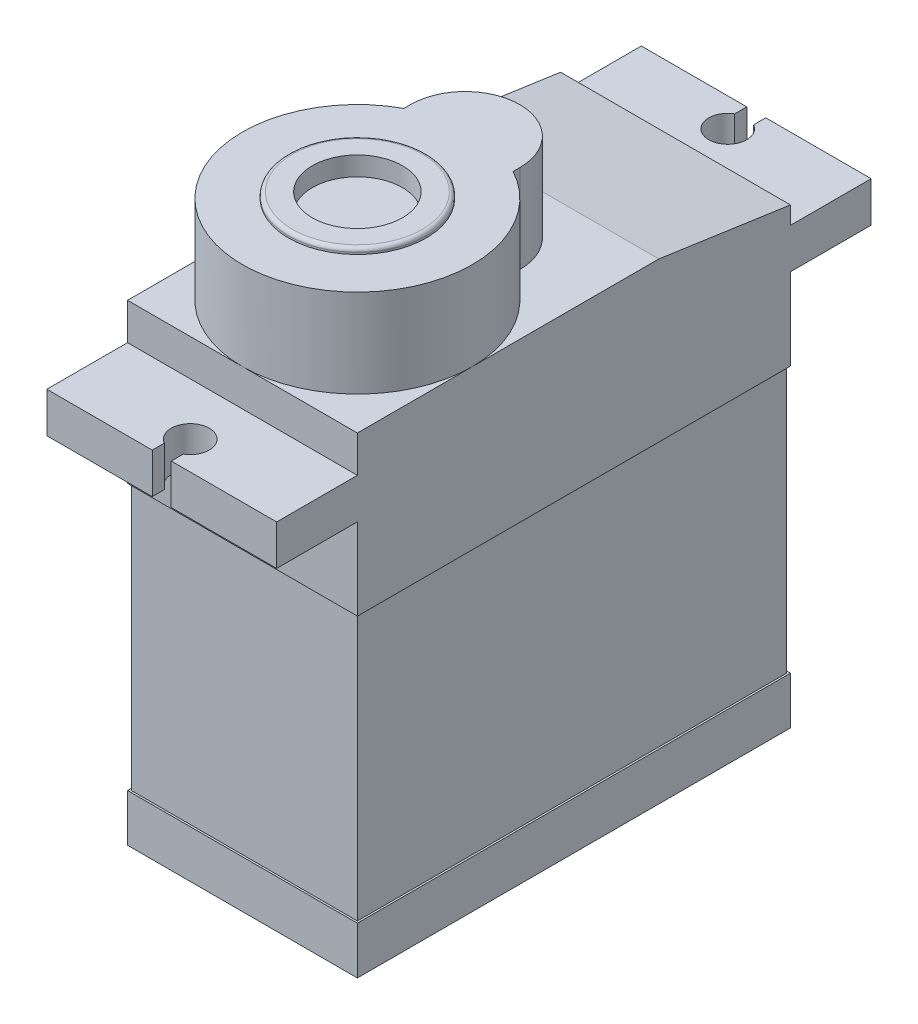
ISO-10303-21;
HEADER;
FILE_DESCRIPTION(('STEP AP214'),'2;1');
FILE_NAME('part.step','',(''),(''),'','','');
FILE_SCHEMA(('AUTOMOTIVE_DESIGN { 1 0 10303 214 1 1 1 1 }'));
ENDSEC;
DATA;
#1=APPLICATION_CONTEXT('core data for automotive mechanical design processes');
#2=APPLICATION_PROTOCOL_DEFINITION('international standard','automotive_design',2000,#1);
#3=PRODUCT_CONTEXT('',#1,'mechanical');
#4=PRODUCT('Part','Part','',(#3));
#5=PRODUCT_RELATED_PRODUCT_CATEGORY('part','',(#4));
#6=PRODUCT_DEFINITION_FORMATION('','',#4);
#7=PRODUCT_DEFINITION_CONTEXT('part definition',#1,'design');
#8=PRODUCT_DEFINITION('design','',#6,#7);
#9=PRODUCT_DEFINITION_SHAPE('','',#8);
#10=(LENGTH_UNIT() NAMED_UNIT(*) SI_UNIT(.MILLI.,.METRE.));
#11=(NAMED_UNIT(*) PLANE_ANGLE_UNIT() SI_UNIT($,.RADIAN.));
#12=(NAMED_UNIT(*) SI_UNIT($,.STERADIAN.) SOLID_ANGLE_UNIT());
#13=UNCERTAINTY_MEASURE_WITH_UNIT(LENGTH_MEASURE(1.E-05),#10,'distance_accuracy_value','');
#14=(GEOMETRIC_REPRESENTATION_CONTEXT(3) GLOBAL_UNCERTAINTY_ASSIGNED_CONTEXT((#13)) GLOBAL_UNIT_ASSIGNED_CONTEXT((#10,
#11,#12)) REPRESENTATION_CONTEXT('',''));
#15=CARTESIAN_POINT('',(0.,0.,0.));
#16=DIRECTION('',(0.,0.,1.));
#17=DIRECTION('',(1.,0.,0.));
#18=AXIS2_PLACEMENT_3D('',#15,#16,#17);
#19=CARTESIAN_POINT('',(6.05,24.85,11.4));
#20=DIRECTION('',(0.,0.,-1.));
#21=DIRECTION('',(-1.,0.,0.));
#22=AXIS2_PLACEMENT_3D('',#19,#20,#21);
#23=PLANE('',#22);
#24=DIRECTION('',(-1.,0.,0.));
#25=VECTOR('',#24,1.);
#26=CARTESIAN_POINT('',(6.05,16.5,11.4));
#27=LINE('',#26,#25);
#28=CARTESIAN_POINT('',(6.05,16.5,11.4));
#29=VERTEX_POINT('',#28);
#30=CARTESIAN_POINT('',(-6.05,16.5,11.4));
#31=VERTEX_POINT('',#30);
#32=EDGE_CURVE('E320',#29,#31,#27,.T.);
#33=ORIENTED_EDGE('',*,*,#32,.F.);
#34=DIRECTION('',(0.,-1.,0.));
#35=VECTOR('',#34,1.);
#36=CARTESIAN_POINT('',(6.05,24.85,11.4));
#37=LINE('',#36,#35);
#38=CARTESIAN_POINT('',(6.05,20.8,11.4));
#39=VERTEX_POINT('',#38);
#40=EDGE_CURVE('E524',#39,#29,#37,.T.);
#41=ORIENTED_EDGE('',*,*,#40,.F.);
#42=DIRECTION('',(1.,0.,0.));
#43=VECTOR('',#42,1.);
#44=CARTESIAN_POINT('',(0.,20.8,11.4));
#45=LINE('',#44,#43);
#46=CARTESIAN_POINT('',(-6.05,20.8,11.4));
#47=VERTEX_POINT('',#46);
#48=EDGE_CURVE('E366',#47,#39,#45,.T.);
#49=ORIENTED_EDGE('',*,*,#48,.F.);
#50=DIRECTION('',(0.,-1.,0.));
#51=VECTOR('',#50,1.);
#52=CARTESIAN_POINT('',(-6.05,24.85,11.4));
#53=LINE('',#52,#51);
#54=EDGE_CURVE('E528',#47,#31,#53,.T.);
#55=ORIENTED_EDGE('',*,*,#54,.T.);
#56=EDGE_LOOP('',(#33,#41,#49,#55));
#57=FACE_BOUND('',#56,.T.);
#58=ADVANCED_FACE('F50',(#57),#23,.F.);
#59=CARTESIAN_POINT('',(-6.05,24.85,11.4));
#60=DIRECTION('',(1.,0.,0.));
#61=DIRECTION('',(0.,0.,-1.));
#62=AXIS2_PLACEMENT_3D('',#59,#60,#61);
#63=PLANE('',#62);
#64=DIRECTION('',(0.,0.,-1.));
#65=VECTOR('',#64,1.);
#66=CARTESIAN_POINT('',(-6.05,16.5,11.4));
#67=LINE('',#66,#65);
#68=CARTESIAN_POINT('',(-6.05,16.5,-11.4));
#69=VERTEX_POINT('',#68);
#70=EDGE_CURVE('E73',#31,#69,#67,.T.);
#71=ORIENTED_EDGE('',*,*,#70,.F.);
#72=ORIENTED_EDGE('',*,*,#54,.F.);
#73=DIRECTION('',(0.,0.,1.));
#74=VECTOR('',#73,1.);
#75=CARTESIAN_POINT('',(-6.05000000000001,20.8,0.));
#76=LINE('',#75,#74);
#77=CARTESIAN_POINT('',(-6.05,20.8,15.65));
#78=VERTEX_POINT('',#77);
#79=EDGE_CURVE('E369',#47,#78,#76,.T.);
#80=ORIENTED_EDGE('',*,*,#79,.T.);
#81=DIRECTION('',(0.,-1.,0.));
#82=VECTOR('',#81,1.);
#83=CARTESIAN_POINT('',(-6.05,22.92,15.65));
#84=LINE('',#83,#82);
#85=CARTESIAN_POINT('',(-6.05,22.92,15.65));
#86=VERTEX_POINT('',#85);
#87=EDGE_CURVE('E374',#86,#78,#84,.T.);
#88=ORIENTED_EDGE('',*,*,#87,.F.);
#89=DIRECTION('',(0.,0.,1.));
#90=VECTOR('',#89,1.);
#91=CARTESIAN_POINT('',(-6.05000000000001,22.92,0.));
#92=LINE('',#91,#90);
#93=CARTESIAN_POINT('',(-6.05,22.92,11.4));
#94=VERTEX_POINT('',#93);
#95=EDGE_CURVE('E352',#94,#86,#92,.T.);
#96=ORIENTED_EDGE('',*,*,#95,.F.);
#97=CARTESIAN_POINT('',(-6.05,24.85,11.4));
#98=VERTEX_POINT('',#97);
#99=EDGE_CURVE('E525',#98,#94,#53,.T.);
#100=ORIENTED_EDGE('',*,*,#99,.F.);
#101=DIRECTION('',(0.,0.,1.));
#102=VECTOR('',#101,1.);
#103=CARTESIAN_POINT('',(-6.05,24.85,11.4));
#104=LINE('',#103,#102);
#105=CARTESIAN_POINT('',(-6.05,24.85,5.35));
#106=VERTEX_POINT('',#105);
#107=EDGE_CURVE('E491',#106,#98,#104,.T.);
#108=ORIENTED_EDGE('',*,*,#107,.F.);
#109=CARTESIAN_POINT('',(-6.05,24.85,-4.47179676972449));
#110=VERTEX_POINT('',#109);
#111=EDGE_CURVE('E487',#110,#106,#104,.T.);
#112=ORIENTED_EDGE('',*,*,#111,.F.);
#113=DIRECTION('',(0.,-0.142857142857142,-0.989743318610787));
#114=VECTOR('',#113,1.);
#115=CARTESIAN_POINT('',(-6.05,23.85,-11.4));
#116=LINE('',#115,#114);
#117=CARTESIAN_POINT('',(-6.05,23.85,-11.4));
#118=VERTEX_POINT('',#117);
#119=EDGE_CURVE('E471',#110,#118,#116,.T.);
#120=ORIENTED_EDGE('',*,*,#119,.T.);
#121=DIRECTION('',(0.,-1.,0.));
#122=VECTOR('',#121,1.);
#123=CARTESIAN_POINT('',(-6.05,24.85,-11.4));
#124=LINE('',#123,#122);
#125=CARTESIAN_POINT('',(-6.05,22.92,-11.4));
#126=VERTEX_POINT('',#125);
#127=EDGE_CURVE('E511',#118,#126,#124,.T.);
#128=ORIENTED_EDGE('',*,*,#127,.T.);
#129=DIRECTION('',(0.,0.,-1.));
#130=VECTOR('',#129,1.);
#131=CARTESIAN_POINT('',(-6.05000000000001,22.92,0.));
#132=LINE('',#131,#130);
#133=CARTESIAN_POINT('',(-6.05,22.92,-15.65));
#134=VERTEX_POINT('',#133);
#135=EDGE_CURVE('E399',#126,#134,#132,.T.);
#136=ORIENTED_EDGE('',*,*,#135,.T.);
#137=DIRECTION('',(0.,-1.,0.));
#138=VECTOR('',#137,1.);
#139=CARTESIAN_POINT('',(-6.05,22.92,-15.65));
#140=LINE('',#139,#138);
#141=CARTESIAN_POINT('',(-6.05,20.8,-15.65));
#142=VERTEX_POINT('',#141);
#143=EDGE_CURVE('E436',#134,#142,#140,.T.);
#144=ORIENTED_EDGE('',*,*,#143,.T.);
#145=DIRECTION('',(0.,0.,-1.));
#146=VECTOR('',#145,1.);
#147=CARTESIAN_POINT('',(-6.05000000000001,20.8,0.));
#148=LINE('',#147,#146);
#149=CARTESIAN_POINT('',(-6.05,20.8,-11.4));
#150=VERTEX_POINT('',#149);
#151=EDGE_CURVE('E420',#150,#142,#148,.T.);
#152=ORIENTED_EDGE('',*,*,#151,.F.);
#153=EDGE_CURVE('E515',#150,#69,#124,.T.);
#154=ORIENTED_EDGE('',*,*,#153,.T.);
#155=EDGE_LOOP('',(#71,#72,#80,#88,#96,#100,#108,#112,#120,#128,#136,#144,#152,#154));
#156=FACE_BOUND('',#155,.T.);
#157=ADVANCED_FACE('F557',(#156),#63,.F.);
#158=CARTESIAN_POINT('',(6.05,24.85,11.4));
#159=DIRECTION('',(-1.,0.,0.));
#160=DIRECTION('',(0.,0.,1.));
#161=AXIS2_PLACEMENT_3D('',#158,#159,#160);
#162=PLANE('',#161);
#163=DIRECTION('',(0.,0.,1.));
#164=VECTOR('',#163,1.);
#165=CARTESIAN_POINT('',(6.05,16.5,-11.4));
#166=LINE('',#165,#164);
#167=CARTESIAN_POINT('',(6.05,16.5,-11.4));
#168=VERTEX_POINT('',#167);
#169=EDGE_CURVE('E325',#168,#29,#166,.T.);
#170=ORIENTED_EDGE('',*,*,#169,.F.);
#171=DIRECTION('',(0.,-1.,0.));
#172=VECTOR('',#171,1.);
#173=CARTESIAN_POINT('',(6.05,24.85,-11.4));
#174=LINE('',#173,#172);
#175=CARTESIAN_POINT('',(6.05,20.8,-11.4));
#176=VERTEX_POINT('',#175);
#177=EDGE_CURVE('E519',#176,#168,#174,.T.);
#178=ORIENTED_EDGE('',*,*,#177,.F.);
#179=DIRECTION('',(0.,0.,-1.));
#180=VECTOR('',#179,1.);
#181=CARTESIAN_POINT('',(6.05,20.8,0.));
#182=LINE('',#181,#180);
#183=CARTESIAN_POINT('',(6.05,20.8,-15.65));
#184=VERTEX_POINT('',#183);
#185=EDGE_CURVE('E426',#176,#184,#182,.T.);
#186=ORIENTED_EDGE('',*,*,#185,.T.);
#187=DIRECTION('',(0.,-1.,0.));
#188=VECTOR('',#187,1.);
#189=CARTESIAN_POINT('',(6.05,22.92,-15.65));
#190=LINE('',#189,#188);
#191=CARTESIAN_POINT('',(6.05,22.92,-15.65));
#192=VERTEX_POINT('',#191);
#193=EDGE_CURVE('E434',#192,#184,#190,.T.);
#194=ORIENTED_EDGE('',*,*,#193,.F.);
#195=DIRECTION('',(0.,0.,-1.));
#196=VECTOR('',#195,1.);
#197=CARTESIAN_POINT('',(6.05,22.92,0.));
#198=LINE('',#197,#196);
#199=CARTESIAN_POINT('',(6.05,22.92,-11.4));
#200=VERTEX_POINT('',#199);
#201=EDGE_CURVE('E406',#200,#192,#198,.T.);
#202=ORIENTED_EDGE('',*,*,#201,.F.);
#203=CARTESIAN_POINT('',(6.05,23.85,-11.4));
#204=VERTEX_POINT('',#203);
#205=EDGE_CURVE('E516',#204,#200,#174,.T.);
#206=ORIENTED_EDGE('',*,*,#205,.F.);
#207=DIRECTION('',(0.,-0.142857142857142,-0.989743318610787));
#208=VECTOR('',#207,1.);
#209=CARTESIAN_POINT('',(6.05,27.0941435438833,11.0760857802097));
#210=LINE('',#209,#208);
#211=CARTESIAN_POINT('',(6.05,24.85,-4.47179676972449));
#212=VERTEX_POINT('',#211);
#213=EDGE_CURVE('E484',#212,#204,#210,.T.);
#214=ORIENTED_EDGE('',*,*,#213,.F.);
#215=DIRECTION('',(0.,0.,-1.));
#216=VECTOR('',#215,1.);
#217=CARTESIAN_POINT('',(6.05,24.85,11.4));
#218=LINE('',#217,#216);
#219=CARTESIAN_POINT('',(6.05,24.85,5.35));
#220=VERTEX_POINT('',#219);
#221=EDGE_CURVE('E495',#220,#212,#218,.T.);
#222=ORIENTED_EDGE('',*,*,#221,.F.);
#223=CARTESIAN_POINT('',(6.05,24.85,11.4));
#224=VERTEX_POINT('',#223);
#225=EDGE_CURVE('E496',#224,#220,#218,.T.);
#226=ORIENTED_EDGE('',*,*,#225,.F.);
#227=CARTESIAN_POINT('',(6.05,22.92,11.4));
#228=VERTEX_POINT('',#227);
#229=EDGE_CURVE('E520',#224,#228,#37,.T.);
#230=ORIENTED_EDGE('',*,*,#229,.T.);
#231=DIRECTION('',(0.,0.,1.));
#232=VECTOR('',#231,1.);
#233=CARTESIAN_POINT('',(6.05000000000001,22.92,0.));
#234=LINE('',#233,#232);
#235=CARTESIAN_POINT('',(6.05,22.92,15.65));
#236=VERTEX_POINT('',#235);
#237=EDGE_CURVE('E346',#228,#236,#234,.T.);
#238=ORIENTED_EDGE('',*,*,#237,.T.);
#239=DIRECTION('',(0.,-1.,0.));
#240=VECTOR('',#239,1.);
#241=CARTESIAN_POINT('',(6.05,22.92,15.65));
#242=LINE('',#241,#240);
#243=CARTESIAN_POINT('',(6.05,20.8,15.65));
#244=VERTEX_POINT('',#243);
#245=EDGE_CURVE('E377',#236,#244,#242,.T.);
#246=ORIENTED_EDGE('',*,*,#245,.T.);
#247=DIRECTION('',(0.,0.,1.));
#248=VECTOR('',#247,1.);
#249=CARTESIAN_POINT('',(6.05000000000001,20.8,0.));
#250=LINE('',#249,#248);
#251=EDGE_CURVE('E363',#39,#244,#250,.T.);
#252=ORIENTED_EDGE('',*,*,#251,.F.);
#253=ORIENTED_EDGE('',*,*,#40,.T.);
#254=EDGE_LOOP('',(#170,#178,#186,#194,#202,#206,#214,#222,#226,#230,#238,#246,#252,#253));
#255=FACE_BOUND('',#254,.T.);
#256=ADVANCED_FACE('F573',(#255),#162,.F.);
#257=CARTESIAN_POINT('',(6.05,24.85,-11.4));
#258=DIRECTION('',(0.,0.,1.));
#259=DIRECTION('',(1.,0.,0.));
#260=AXIS2_PLACEMENT_3D('',#257,#258,#259);
#261=PLANE('',#260);
#262=DIRECTION('',(1.,0.,0.));
#263=VECTOR('',#262,1.);
#264=CARTESIAN_POINT('',(-6.05,16.5,-11.4));
#265=LINE('',#264,#263);
#266=EDGE_CURVE('E323',#69,#168,#265,.T.);
#267=ORIENTED_EDGE('',*,*,#266,.F.);
#268=ORIENTED_EDGE('',*,*,#153,.F.);
#269=DIRECTION('',(1.,0.,0.));
#270=VECTOR('',#269,1.);
#271=CARTESIAN_POINT('',(0.,20.8,-11.4));
#272=LINE('',#271,#270);
#273=EDGE_CURVE('E424',#150,#176,#272,.T.);
#274=ORIENTED_EDGE('',*,*,#273,.T.);
#275=ORIENTED_EDGE('',*,*,#177,.T.);
#276=EDGE_LOOP('',(#267,#268,#274,#275));
#277=FACE_BOUND('',#276,.T.);
#278=ADVANCED_FACE('F606',(#277),#261,.F.);
#279=DIRECTION('',(1.,0.,0.));
#280=VECTOR('',#279,1.);
#281=CARTESIAN_POINT('',(0.,22.92,-11.4));
#282=LINE('',#281,#280);
#283=EDGE_CURVE('E403',#126,#200,#282,.T.);
#284=ORIENTED_EDGE('',*,*,#283,.F.);
#285=ORIENTED_EDGE('',*,*,#127,.F.);
#286=DIRECTION('',(-1.,0.,0.));
#287=VECTOR('',#286,1.);
#288=CARTESIAN_POINT('',(18.8,23.85,-11.4));
#289=LINE('',#288,#287);
#290=EDGE_CURVE('E482',#204,#118,#289,.T.);
#291=ORIENTED_EDGE('',*,*,#290,.F.);
#292=ORIENTED_EDGE('',*,*,#205,.T.);
#293=EDGE_LOOP('',(#284,#285,#291,#292));
#294=FACE_BOUND('',#293,.T.);
#295=ADVANCED_FACE('F581',(#294),#261,.F.);
#296=CARTESIAN_POINT('',(0.,24.85,0.));
#297=DIRECTION('',(0.,1.,0.));
#298=DIRECTION('',(0.,0.,1.));
#299=AXIS2_PLACEMENT_3D('',#296,#297,#298);
#300=PLANE('',#299);
#301=CARTESIAN_POINT('',(0.,24.85,5.35));
#302=DIRECTION('',(0.,1.,0.));
#303=DIRECTION('',(0.,0.,1.));
#304=AXIS2_PLACEMENT_3D('',#301,#302,#303);
#305=CIRCLE('',#304,6.05);
#306=CARTESIAN_POINT('',(0.,24.85,11.4));
#307=VERTEX_POINT('',#306);
#308=EDGE_CURVE('E448',#106,#307,#305,.T.);
#309=ORIENTED_EDGE('',*,*,#308,.F.);
#310=ORIENTED_EDGE('',*,*,#107,.T.);
#311=DIRECTION('',(1.,0.,0.));
#312=VECTOR('',#311,1.);
#313=CARTESIAN_POINT('',(6.05,24.85,11.4));
#314=LINE('',#313,#312);
#315=EDGE_CURVE('E492',#98,#307,#314,.T.);
#316=ORIENTED_EDGE('',*,*,#315,.T.);
#317=EDGE_LOOP('',(#309,#310,#316));
#318=FACE_BOUND('',#317,.T.);
#319=ADVANCED_FACE('F563',(#318),#300,.T.);
#320=EDGE_CURVE('E534',#307,#220,#305,.T.);
#321=ORIENTED_EDGE('',*,*,#320,.F.);
#322=EDGE_CURVE('E490',#307,#224,#314,.T.);
#323=ORIENTED_EDGE('',*,*,#322,.T.);
#324=ORIENTED_EDGE('',*,*,#225,.T.);
#325=EDGE_LOOP('',(#321,#323,#324));
#326=FACE_BOUND('',#325,.T.);
#327=ADVANCED_FACE('F570',(#326),#300,.T.);
#328=CARTESIAN_POINT('',(2.875,24.85,0.0267608545172443));
#329=VERTEX_POINT('',#328);
#330=EDGE_CURVE('E449',#220,#329,#305,.T.);
#331=ORIENTED_EDGE('',*,*,#330,.F.);
#332=ORIENTED_EDGE('',*,*,#221,.T.);
#333=DIRECTION('',(-1.,0.,0.));
#334=VECTOR('',#333,1.);
#335=CARTESIAN_POINT('',(0.,24.85,-4.47179676972449));
#336=LINE('',#335,#334);
#337=EDGE_CURVE('E527',#212,#110,#336,.T.);
#338=ORIENTED_EDGE('',*,*,#337,.T.);
#339=ORIENTED_EDGE('',*,*,#111,.T.);
#340=CARTESIAN_POINT('',(-2.875,24.85,0.0267608545172434));
#341=VERTEX_POINT('',#340);
#342=EDGE_CURVE('E443',#341,#106,#305,.T.);
#343=ORIENTED_EDGE('',*,*,#342,.F.);
#344=DIRECTION('',(0.,0.,1.));
#345=VECTOR('',#344,1.);
#346=CARTESIAN_POINT('',(-2.875,24.85,0.));
#347=LINE('',#346,#345);
#348=CARTESIAN_POINT('',(-2.875,24.85,-0.324999999999999));
#349=VERTEX_POINT('',#348);
#350=EDGE_CURVE('E450',#349,#341,#347,.T.);
#351=ORIENTED_EDGE('',*,*,#350,.F.);
#352=CARTESIAN_POINT('',(0.,24.85,-0.325));
#353=DIRECTION('',(0.,1.,0.));
#354=DIRECTION('',(0.,0.,1.));
#355=AXIS2_PLACEMENT_3D('',#352,#353,#354);
#356=CIRCLE('',#355,2.875);
#357=CARTESIAN_POINT('',(2.875,24.85,-0.325));
#358=VERTEX_POINT('',#357);
#359=EDGE_CURVE('E454',#358,#349,#356,.T.);
#360=ORIENTED_EDGE('',*,*,#359,.F.);
#361=DIRECTION('',(0.,0.,1.));
#362=VECTOR('',#361,1.);
#363=CARTESIAN_POINT('',(2.875,24.85,0.));
#364=LINE('',#363,#362);
#365=EDGE_CURVE('E446',#358,#329,#364,.T.);
#366=ORIENTED_EDGE('',*,*,#365,.T.);
#367=EDGE_LOOP('',(#331,#332,#338,#339,#343,#351,#360,#366));
#368=FACE_BOUND('',#367,.T.);
#369=ADVANCED_FACE('F552',(#368),#300,.T.);
#370=ORIENTED_EDGE('',*,*,#99,.T.);
#371=DIRECTION('',(1.,0.,0.));
#372=VECTOR('',#371,1.);
#373=CARTESIAN_POINT('',(0.,22.92,11.4));
#374=LINE('',#373,#372);
#375=EDGE_CURVE('E350',#94,#228,#374,.T.);
#376=ORIENTED_EDGE('',*,*,#375,.T.);
#377=ORIENTED_EDGE('',*,*,#229,.F.);
#378=ORIENTED_EDGE('',*,*,#322,.F.);
#379=ORIENTED_EDGE('',*,*,#315,.F.);
#380=EDGE_LOOP('',(#370,#376,#377,#378,#379));
#381=FACE_BOUND('',#380,.T.);
#382=ADVANCED_FACE('F566',(#381),#23,.F.);
#383=CARTESIAN_POINT('',(18.8,23.85,-11.4));
#384=DIRECTION('',(0.,0.989743318610787,-0.142857142857142));
#385=DIRECTION('',(0.,0.142857142857142,0.989743318610787));
#386=AXIS2_PLACEMENT_3D('',#383,#384,#385);
#387=PLANE('',#386);
#388=ORIENTED_EDGE('',*,*,#213,.T.);
#389=ORIENTED_EDGE('',*,*,#290,.T.);
#390=ORIENTED_EDGE('',*,*,#119,.F.);
#391=ORIENTED_EDGE('',*,*,#337,.F.);
#392=EDGE_LOOP('',(#388,#389,#390,#391));
#393=FACE_BOUND('',#392,.T.);
#394=ADVANCED_FACE('F578',(#393),#387,.T.);
#395=CARTESIAN_POINT('',(2.875,77.9623310803287,0.));
#396=DIRECTION('',(1.,0.,0.));
#397=DIRECTION('',(0.,0.,-1.));
#398=AXIS2_PLACEMENT_3D('',#395,#396,#397);
#399=PLANE('',#398);
#400=DIRECTION('',(0.,-1.,0.));
#401=VECTOR('',#400,1.);
#402=CARTESIAN_POINT('',(2.875,77.9623310803287,-0.325));
#403=LINE('',#402,#401);
#404=CARTESIAN_POINT('',(2.875,29.5,-0.325));
#405=VERTEX_POINT('',#404);
#406=EDGE_CURVE('E457',#405,#358,#403,.T.);
#407=ORIENTED_EDGE('',*,*,#406,.F.);
#408=DIRECTION('',(0.,0.,1.));
#409=VECTOR('',#408,1.);
#410=CARTESIAN_POINT('',(2.875,29.5,0.));
#411=LINE('',#410,#409);
#412=CARTESIAN_POINT('',(2.875,29.5,0.026760854517245));
#413=VERTEX_POINT('',#412);
#414=EDGE_CURVE('E442',#405,#413,#411,.T.);
#415=ORIENTED_EDGE('',*,*,#414,.T.);
#416=DIRECTION('',(0.,-1.,0.));
#417=VECTOR('',#416,1.);
#418=CARTESIAN_POINT('',(2.875,77.9623310803287,0.0267608545172443));
#419=LINE('',#418,#417);
#420=EDGE_CURVE('E468',#413,#329,#419,.T.);
#421=ORIENTED_EDGE('',*,*,#420,.T.);
#422=ORIENTED_EDGE('',*,*,#365,.F.);
#423=EDGE_LOOP('',(#407,#415,#421,#422));
#424=FACE_BOUND('',#423,.T.);
#425=ADVANCED_FACE('F545',(#424),#399,.T.);
#426=CARTESIAN_POINT('',(0.,77.9623310803287,-0.325));
#427=DIRECTION('',(0.,-1.,0.));
#428=DIRECTION('',(0.,0.,-1.));
#429=AXIS2_PLACEMENT_3D('',#426,#427,#428);
#430=CYLINDRICAL_SURFACE('',#429,2.875);
#431=CARTESIAN_POINT('',(0.,29.5,-0.325));
#432=DIRECTION('',(0.,1.,0.));
#433=DIRECTION('',(0.,0.,1.));
#434=AXIS2_PLACEMENT_3D('',#431,#432,#433);
#435=CIRCLE('',#434,2.875);
#436=CARTESIAN_POINT('',(-2.875,29.5,-0.324999999999999));
#437=VERTEX_POINT('',#436);
#438=EDGE_CURVE('E459',#405,#437,#435,.T.);
#439=ORIENTED_EDGE('',*,*,#438,.F.);
#440=ORIENTED_EDGE('',*,*,#406,.T.);
#441=ORIENTED_EDGE('',*,*,#359,.T.);
#442=DIRECTION('',(0.,-1.,0.));
#443=VECTOR('',#442,1.);
#444=CARTESIAN_POINT('',(-2.875,77.9623310803287,-0.324999999999999));
#445=LINE('',#444,#443);
#446=EDGE_CURVE('E453',#437,#349,#445,.T.);
#447=ORIENTED_EDGE('',*,*,#446,.F.);
#448=EDGE_LOOP('',(#439,#440,#441,#447));
#449=FACE_BOUND('',#448,.T.);
#450=ADVANCED_FACE('F734',(#449),#430,.T.);
#451=CARTESIAN_POINT('',(-2.875,77.9623310803287,0.));
#452=DIRECTION('',(1.,0.,0.));
#453=DIRECTION('',(0.,0.,-1.));
#454=AXIS2_PLACEMENT_3D('',#451,#452,#453);
#455=PLANE('',#454);
#456=DIRECTION('',(0.,0.,1.));
#457=VECTOR('',#456,1.);
#458=CARTESIAN_POINT('',(-2.875,29.5,0.));
#459=LINE('',#458,#457);
#460=CARTESIAN_POINT('',(-2.875,29.5,0.0267608545172434));
#461=VERTEX_POINT('',#460);
#462=EDGE_CURVE('E460',#437,#461,#459,.T.);
#463=ORIENTED_EDGE('',*,*,#462,.F.);
#464=ORIENTED_EDGE('',*,*,#446,.T.);
#465=ORIENTED_EDGE('',*,*,#350,.T.);
#466=DIRECTION('',(0.,-1.,0.));
#467=VECTOR('',#466,1.);
#468=CARTESIAN_POINT('',(-2.875,77.9623310803287,0.0267608545172434));
#469=LINE('',#468,#467);
#470=EDGE_CURVE('E447',#461,#341,#469,.T.);
#471=ORIENTED_EDGE('',*,*,#470,.F.);
#472=EDGE_LOOP('',(#463,#464,#465,#471));
#473=FACE_BOUND('',#472,.T.);
#474=ADVANCED_FACE('F550',(#473),#455,.F.);
#475=CARTESIAN_POINT('',(0.,77.9623310803287,5.35));
#476=DIRECTION('',(0.,-1.,0.));
#477=DIRECTION('',(0.,0.,-1.));
#478=AXIS2_PLACEMENT_3D('',#475,#476,#477);
#479=CYLINDRICAL_SURFACE('',#478,6.05);
#480=CARTESIAN_POINT('',(0.,29.5,5.35));
#481=DIRECTION('',(0.,1.,0.));
#482=DIRECTION('',(0.,0.,1.));
#483=AXIS2_PLACEMENT_3D('',#480,#481,#482);
#484=CIRCLE('',#483,6.05);
#485=EDGE_CURVE('E463',#461,#413,#484,.T.);
#486=ORIENTED_EDGE('',*,*,#485,.F.);
#487=ORIENTED_EDGE('',*,*,#470,.T.);
#488=ORIENTED_EDGE('',*,*,#342,.T.);
#489=ORIENTED_EDGE('',*,*,#308,.T.);
#490=ORIENTED_EDGE('',*,*,#320,.T.);
#491=ORIENTED_EDGE('',*,*,#330,.T.);
#492=ORIENTED_EDGE('',*,*,#420,.F.);
#493=EDGE_LOOP('',(#486,#487,#488,#489,#490,#491,#492));
#494=FACE_BOUND('',#493,.T.);
#495=ADVANCED_FACE('F539',(#494),#479,.T.);
#496=CARTESIAN_POINT('',(0.,29.5,0.));
#497=DIRECTION('',(0.,1.,0.));
#498=DIRECTION('',(0.,0.,1.));
#499=AXIS2_PLACEMENT_3D('',#496,#497,#498);
#500=PLANE('',#499);
#501=CARTESIAN_POINT('',(0.,29.5,5.35));
#502=DIRECTION('',(0.,1.,0.));
#503=DIRECTION('',(0.,0.,1.));
#504=AXIS2_PLACEMENT_3D('',#501,#502,#503);
#505=CIRCLE('',#504,3.625);
#506=CARTESIAN_POINT('',(0.,29.5,8.975));
#507=VERTEX_POINT('',#506);
#508=EDGE_CURVE('E305',#507,#507,#505,.T.);
#509=ORIENTED_EDGE('',*,*,#508,.F.);
#510=EDGE_LOOP('',(#509));
#511=FACE_BOUND('',#510,.T.);
#512=ORIENTED_EDGE('',*,*,#414,.F.);
#513=ORIENTED_EDGE('',*,*,#438,.T.);
#514=ORIENTED_EDGE('',*,*,#462,.T.);
#515=ORIENTED_EDGE('',*,*,#485,.T.);
#516=EDGE_LOOP('',(#512,#513,#514,#515));
#517=FACE_BOUND('',#516,.T.);
#518=ADVANCED_FACE('F548',(#511,#517),#500,.T.);
#519=CARTESIAN_POINT('',(0.,22.92,-14.15));
#520=DIRECTION('',(0.,-1.,0.));
#521=DIRECTION('',(0.,0.,-1.));
#522=AXIS2_PLACEMENT_3D('',#519,#520,#521);
#523=CYLINDRICAL_SURFACE('',#522,1.);
#524=CARTESIAN_POINT('',(0.,20.8,-14.15));
#525=DIRECTION('',(0.,1.,0.));
#526=DIRECTION('',(0.,0.,1.));
#527=AXIS2_PLACEMENT_3D('',#524,#525,#526);
#528=CIRCLE('',#527,1.);
#529=CARTESIAN_POINT('',(-0.500000000000002,20.8,-15.0160254037844));
#530=VERTEX_POINT('',#529);
#531=CARTESIAN_POINT('',(0.499999999999994,20.8,-15.0160254037844));
#532=VERTEX_POINT('',#531);
#533=EDGE_CURVE('E388',#530,#532,#528,.T.);
#534=ORIENTED_EDGE('',*,*,#533,.F.);
#535=DIRECTION('',(0.,-1.,0.));
#536=VECTOR('',#535,1.);
#537=CARTESIAN_POINT('',(-0.500000000000002,22.92,-15.0160254037844));
#538=LINE('',#537,#536);
#539=CARTESIAN_POINT('',(-0.500000000000002,22.92,-15.0160254037844));
#540=VERTEX_POINT('',#539);
#541=EDGE_CURVE('E440',#540,#530,#538,.T.);
#542=ORIENTED_EDGE('',*,*,#541,.F.);
#543=CARTESIAN_POINT('',(0.,22.92,-14.15));
#544=DIRECTION('',(0.,1.,0.));
#545=DIRECTION('',(0.,0.,1.));
#546=AXIS2_PLACEMENT_3D('',#543,#544,#545);
#547=CIRCLE('',#546,1.);
#548=CARTESIAN_POINT('',(0.499999999999994,22.92,-15.0160254037844));
#549=VERTEX_POINT('',#548);
#550=EDGE_CURVE('E389',#540,#549,#547,.T.);
#551=ORIENTED_EDGE('',*,*,#550,.T.);
#552=DIRECTION('',(0.,-1.,0.));
#553=VECTOR('',#552,1.);
#554=CARTESIAN_POINT('',(0.499999999999994,22.92,-15.0160254037844));
#555=LINE('',#554,#553);
#556=EDGE_CURVE('E411',#549,#532,#555,.T.);
#557=ORIENTED_EDGE('',*,*,#556,.T.);
#558=EDGE_LOOP('',(#534,#542,#551,#557));
#559=FACE_BOUND('',#558,.T.);
#560=ADVANCED_FACE('F724',(#559),#523,.F.);
#561=CARTESIAN_POINT('',(-0.499999999999996,22.92,0.));
#562=DIRECTION('',(1.,0.,0.));
#563=DIRECTION('',(0.,0.,-1.));
#564=AXIS2_PLACEMENT_3D('',#561,#562,#563);
#565=PLANE('',#564);
#566=DIRECTION('',(0.,0.,1.));
#567=VECTOR('',#566,1.);
#568=CARTESIAN_POINT('',(-0.499999999999996,20.8,0.));
#569=LINE('',#568,#567);
#570=CARTESIAN_POINT('',(-0.500000000000002,20.8,-15.65));
#571=VERTEX_POINT('',#570);
#572=EDGE_CURVE('E414',#571,#530,#569,.T.);
#573=ORIENTED_EDGE('',*,*,#572,.F.);
#574=DIRECTION('',(0.,-1.,0.));
#575=VECTOR('',#574,1.);
#576=CARTESIAN_POINT('',(-0.500000000000002,22.92,-15.65));
#577=LINE('',#576,#575);
#578=CARTESIAN_POINT('',(-0.500000000000002,22.92,-15.65));
#579=VERTEX_POINT('',#578);
#580=EDGE_CURVE('E438',#579,#571,#577,.T.);
#581=ORIENTED_EDGE('',*,*,#580,.F.);
#582=DIRECTION('',(0.,0.,1.));
#583=VECTOR('',#582,1.);
#584=CARTESIAN_POINT('',(-0.499999999999996,22.92,0.));
#585=LINE('',#584,#583);
#586=EDGE_CURVE('E392',#579,#540,#585,.T.);
#587=ORIENTED_EDGE('',*,*,#586,.T.);
#588=ORIENTED_EDGE('',*,*,#541,.T.);
#589=EDGE_LOOP('',(#573,#581,#587,#588));
#590=FACE_BOUND('',#589,.T.);
#591=ADVANCED_FACE('F728',(#590),#565,.T.);
#592=CARTESIAN_POINT('',(0.,22.92,-15.65));
#593=DIRECTION('',(0.,0.,-1.));
#594=DIRECTION('',(-1.,0.,0.));
#595=AXIS2_PLACEMENT_3D('',#592,#593,#594);
#596=PLANE('',#595);
#597=DIRECTION('',(1.,0.,0.));
#598=VECTOR('',#597,1.);
#599=CARTESIAN_POINT('',(0.,20.8,-15.65));
#600=LINE('',#599,#598);
#601=EDGE_CURVE('E417',#142,#571,#600,.T.);
#602=ORIENTED_EDGE('',*,*,#601,.F.);
#603=ORIENTED_EDGE('',*,*,#143,.F.);
#604=DIRECTION('',(1.,0.,0.));
#605=VECTOR('',#604,1.);
#606=CARTESIAN_POINT('',(0.,22.92,-15.65));
#607=LINE('',#606,#605);
#608=EDGE_CURVE('E396',#134,#579,#607,.T.);
#609=ORIENTED_EDGE('',*,*,#608,.T.);
#610=ORIENTED_EDGE('',*,*,#580,.T.);
#611=EDGE_LOOP('',(#602,#603,#609,#610));
#612=FACE_BOUND('',#611,.T.);
#613=ADVANCED_FACE('F596',(#612),#596,.T.);
#614=CARTESIAN_POINT('',(0.499999999999994,20.8,-15.65));
#615=VERTEX_POINT('',#614);
#616=EDGE_CURVE('E421',#615,#184,#600,.T.);
#617=ORIENTED_EDGE('',*,*,#616,.F.);
#618=DIRECTION('',(0.,-1.,0.));
#619=VECTOR('',#618,1.);
#620=CARTESIAN_POINT('',(0.499999999999994,22.92,-15.65));
#621=LINE('',#620,#619);
#622=CARTESIAN_POINT('',(0.499999999999994,22.92,-15.65));
#623=VERTEX_POINT('',#622);
#624=EDGE_CURVE('E432',#623,#615,#621,.T.);
#625=ORIENTED_EDGE('',*,*,#624,.F.);
#626=EDGE_CURVE('E400',#623,#192,#607,.T.);
#627=ORIENTED_EDGE('',*,*,#626,.T.);
#628=ORIENTED_EDGE('',*,*,#193,.T.);
#629=EDGE_LOOP('',(#617,#625,#627,#628));
#630=FACE_BOUND('',#629,.T.);
#631=ADVANCED_FACE('F743',(#630),#596,.T.);
#632=CARTESIAN_POINT('',(0.499999999999997,22.92,0.));
#633=DIRECTION('',(-1.,0.,0.));
#634=DIRECTION('',(0.,0.,1.));
#635=AXIS2_PLACEMENT_3D('',#632,#633,#634);
#636=PLANE('',#635);
#637=DIRECTION('',(0.,0.,-1.));
#638=VECTOR('',#637,1.);
#639=CARTESIAN_POINT('',(0.499999999999997,20.8,0.));
#640=LINE('',#639,#638);
#641=EDGE_CURVE('E393',#532,#615,#640,.T.);
#642=ORIENTED_EDGE('',*,*,#641,.F.);
#643=ORIENTED_EDGE('',*,*,#556,.F.);
#644=DIRECTION('',(0.,0.,-1.));
#645=VECTOR('',#644,1.);
#646=CARTESIAN_POINT('',(0.499999999999997,22.92,0.));
#647=LINE('',#646,#645);
#648=EDGE_CURVE('E408',#549,#623,#647,.T.);
#649=ORIENTED_EDGE('',*,*,#648,.T.);
#650=ORIENTED_EDGE('',*,*,#624,.T.);
#651=EDGE_LOOP('',(#642,#643,#649,#650));
#652=FACE_BOUND('',#651,.T.);
#653=ADVANCED_FACE('F746',(#652),#636,.T.);
#654=CARTESIAN_POINT('',(0.,22.92,0.));
#655=DIRECTION('',(0.,1.,0.));
#656=DIRECTION('',(0.,0.,1.));
#657=AXIS2_PLACEMENT_3D('',#654,#655,#656);
#658=PLANE('',#657);
#659=ORIENTED_EDGE('',*,*,#550,.F.);
#660=ORIENTED_EDGE('',*,*,#586,.F.);
#661=ORIENTED_EDGE('',*,*,#608,.F.);
#662=ORIENTED_EDGE('',*,*,#135,.F.);
#663=ORIENTED_EDGE('',*,*,#283,.T.);
#664=ORIENTED_EDGE('',*,*,#201,.T.);
#665=ORIENTED_EDGE('',*,*,#626,.F.);
#666=ORIENTED_EDGE('',*,*,#648,.F.);
#667=EDGE_LOOP('',(#659,#660,#661,#662,#663,#664,#665,#666));
#668=FACE_BOUND('',#667,.T.);
#669=ADVANCED_FACE('F588',(#668),#658,.T.);
#670=CARTESIAN_POINT('',(0.,20.8,0.));
#671=DIRECTION('',(0.,1.,0.));
#672=DIRECTION('',(0.,0.,1.));
#673=AXIS2_PLACEMENT_3D('',#670,#671,#672);
#674=PLANE('',#673);
#675=ORIENTED_EDGE('',*,*,#533,.T.);
#676=ORIENTED_EDGE('',*,*,#641,.T.);
#677=ORIENTED_EDGE('',*,*,#616,.T.);
#678=ORIENTED_EDGE('',*,*,#185,.F.);
#679=ORIENTED_EDGE('',*,*,#273,.F.);
#680=ORIENTED_EDGE('',*,*,#151,.T.);
#681=ORIENTED_EDGE('',*,*,#601,.T.);
#682=ORIENTED_EDGE('',*,*,#572,.T.);
#683=EDGE_LOOP('',(#675,#676,#677,#678,#679,#680,#681,#682));
#684=FACE_BOUND('',#683,.T.);
#685=ADVANCED_FACE('F600',(#684),#674,.F.);
#686=CARTESIAN_POINT('',(-0.499999999999998,22.92,0.));
#687=DIRECTION('',(-1.,0.,0.));
#688=DIRECTION('',(0.,0.,1.));
#689=AXIS2_PLACEMENT_3D('',#686,#687,#688);
#690=PLANE('',#689);
#691=DIRECTION('',(0.,0.,-1.));
#692=VECTOR('',#691,1.);
#693=CARTESIAN_POINT('',(-0.499999999999998,20.8,0.));
#694=LINE('',#693,#692);
#695=CARTESIAN_POINT('',(-0.500000000000003,20.8,15.65));
#696=VERTEX_POINT('',#695);
#697=CARTESIAN_POINT('',(-0.500000000000003,20.8,15.0160254037844));
#698=VERTEX_POINT('',#697);
#699=EDGE_CURVE('E327',#696,#698,#694,.T.);
#700=ORIENTED_EDGE('',*,*,#699,.T.);
#701=DIRECTION('',(0.,-1.,0.));
#702=VECTOR('',#701,1.);
#703=CARTESIAN_POINT('',(-0.500000000000003,22.92,15.0160254037844));
#704=LINE('',#703,#702);
#705=CARTESIAN_POINT('',(-0.500000000000003,22.92,15.0160254037844));
#706=VERTEX_POINT('',#705);
#707=EDGE_CURVE('E385',#706,#698,#704,.T.);
#708=ORIENTED_EDGE('',*,*,#707,.F.);
#709=DIRECTION('',(0.,0.,-1.));
#710=VECTOR('',#709,1.);
#711=CARTESIAN_POINT('',(-0.499999999999998,22.92,0.));
#712=LINE('',#711,#710);
#713=CARTESIAN_POINT('',(-0.500000000000003,22.92,15.65));
#714=VERTEX_POINT('',#713);
#715=EDGE_CURVE('E336',#714,#706,#712,.T.);
#716=ORIENTED_EDGE('',*,*,#715,.F.);
#717=DIRECTION('',(0.,-1.,0.));
#718=VECTOR('',#717,1.);
#719=CARTESIAN_POINT('',(-0.500000000000003,22.92,15.65));
#720=LINE('',#719,#718);
#721=EDGE_CURVE('E371',#714,#696,#720,.T.);
#722=ORIENTED_EDGE('',*,*,#721,.T.);
#723=EDGE_LOOP('',(#700,#708,#716,#722));
#724=FACE_BOUND('',#723,.T.);
#725=ADVANCED_FACE('F753',(#724),#690,.F.);
#726=CARTESIAN_POINT('',(0.,22.92,14.15));
#727=DIRECTION('',(0.,-1.,0.));
#728=DIRECTION('',(0.,0.,-1.));
#729=AXIS2_PLACEMENT_3D('',#726,#727,#728);
#730=CYLINDRICAL_SURFACE('',#729,1.);
#731=CARTESIAN_POINT('',(0.,20.8,14.15));
#732=DIRECTION('',(0.,1.,0.));
#733=DIRECTION('',(0.,0.,1.));
#734=AXIS2_PLACEMENT_3D('',#731,#732,#733);
#735=CIRCLE('',#734,1.);
#736=CARTESIAN_POINT('',(0.499999999999992,20.8,15.0160254037844));
#737=VERTEX_POINT('',#736);
#738=EDGE_CURVE('E356',#698,#737,#735,.F.);
#739=ORIENTED_EDGE('',*,*,#738,.T.);
#740=DIRECTION('',(0.,-1.,0.));
#741=VECTOR('',#740,1.);
#742=CARTESIAN_POINT('',(0.499999999999992,22.92,15.0160254037844));
#743=LINE('',#742,#741);
#744=CARTESIAN_POINT('',(0.499999999999992,22.92,15.0160254037844));
#745=VERTEX_POINT('',#744);
#746=EDGE_CURVE('E382',#745,#737,#743,.T.);
#747=ORIENTED_EDGE('',*,*,#746,.F.);
#748=CARTESIAN_POINT('',(0.,22.92,14.15));
#749=DIRECTION('',(0.,1.,0.));
#750=DIRECTION('',(0.,0.,1.));
#751=AXIS2_PLACEMENT_3D('',#748,#749,#750);
#752=CIRCLE('',#751,1.);
#753=EDGE_CURVE('E339',#706,#745,#752,.F.);
#754=ORIENTED_EDGE('',*,*,#753,.F.);
#755=ORIENTED_EDGE('',*,*,#707,.T.);
#756=EDGE_LOOP('',(#739,#747,#754,#755));
#757=FACE_BOUND('',#756,.T.);
#758=ADVANCED_FACE('F758',(#757),#730,.F.);
#759=CARTESIAN_POINT('',(0.499999999999995,22.92,0.));
#760=DIRECTION('',(1.,0.,0.));
#761=DIRECTION('',(0.,0.,-1.));
#762=AXIS2_PLACEMENT_3D('',#759,#760,#761);
#763=PLANE('',#762);
#764=DIRECTION('',(0.,0.,1.));
#765=VECTOR('',#764,1.);
#766=CARTESIAN_POINT('',(0.499999999999995,20.8,0.));
#767=LINE('',#766,#765);
#768=CARTESIAN_POINT('',(0.499999999999992,20.8,15.65));
#769=VERTEX_POINT('',#768);
#770=EDGE_CURVE('E358',#737,#769,#767,.T.);
#771=ORIENTED_EDGE('',*,*,#770,.T.);
#772=DIRECTION('',(0.,-1.,0.));
#773=VECTOR('',#772,1.);
#774=CARTESIAN_POINT('',(0.499999999999992,22.92,15.65));
#775=LINE('',#774,#773);
#776=CARTESIAN_POINT('',(0.499999999999992,22.92,15.65));
#777=VERTEX_POINT('',#776);
#778=EDGE_CURVE('E379',#777,#769,#775,.T.);
#779=ORIENTED_EDGE('',*,*,#778,.F.);
#780=DIRECTION('',(0.,0.,1.));
#781=VECTOR('',#780,1.);
#782=CARTESIAN_POINT('',(0.499999999999995,22.92,0.));
#783=LINE('',#782,#781);
#784=EDGE_CURVE('E342',#745,#777,#783,.T.);
#785=ORIENTED_EDGE('',*,*,#784,.F.);
#786=ORIENTED_EDGE('',*,*,#746,.T.);
#787=EDGE_LOOP('',(#771,#779,#785,#786));
#788=FACE_BOUND('',#787,.T.);
#789=ADVANCED_FACE('F762',(#788),#763,.F.);
#790=CARTESIAN_POINT('',(0.,22.92,15.65));
#791=DIRECTION('',(0.,0.,-1.));
#792=DIRECTION('',(-1.,0.,0.));
#793=AXIS2_PLACEMENT_3D('',#790,#791,#792);
#794=PLANE('',#793);
#795=DIRECTION('',(1.,0.,0.));
#796=VECTOR('',#795,1.);
#797=CARTESIAN_POINT('',(0.,20.8,15.65));
#798=LINE('',#797,#796);
#799=EDGE_CURVE('E360',#769,#244,#798,.T.);
#800=ORIENTED_EDGE('',*,*,#799,.T.);
#801=ORIENTED_EDGE('',*,*,#245,.F.);
#802=DIRECTION('',(1.,0.,0.));
#803=VECTOR('',#802,1.);
#804=CARTESIAN_POINT('',(0.,22.92,15.65));
#805=LINE('',#804,#803);
#806=EDGE_CURVE('E344',#777,#236,#805,.T.);
#807=ORIENTED_EDGE('',*,*,#806,.F.);
#808=ORIENTED_EDGE('',*,*,#778,.T.);
#809=EDGE_LOOP('',(#800,#801,#807,#808));
#810=FACE_BOUND('',#809,.T.);
#811=ADVANCED_FACE('F766',(#810),#794,.F.);
#812=EDGE_CURVE('E340',#78,#696,#798,.T.);
#813=ORIENTED_EDGE('',*,*,#812,.T.);
#814=ORIENTED_EDGE('',*,*,#721,.F.);
#815=EDGE_CURVE('E347',#86,#714,#805,.T.);
#816=ORIENTED_EDGE('',*,*,#815,.F.);
#817=ORIENTED_EDGE('',*,*,#87,.T.);
#818=EDGE_LOOP('',(#813,#814,#816,#817));
#819=FACE_BOUND('',#818,.T.);
#820=ADVANCED_FACE('F768',(#819),#794,.F.);
#821=CARTESIAN_POINT('',(0.,22.92,0.));
#822=DIRECTION('',(0.,1.,0.));
#823=DIRECTION('',(0.,0.,1.));
#824=AXIS2_PLACEMENT_3D('',#821,#822,#823);
#825=PLANE('',#824);
#826=ORIENTED_EDGE('',*,*,#715,.T.);
#827=ORIENTED_EDGE('',*,*,#753,.T.);
#828=ORIENTED_EDGE('',*,*,#784,.T.);
#829=ORIENTED_EDGE('',*,*,#806,.T.);
#830=ORIENTED_EDGE('',*,*,#237,.F.);
#831=ORIENTED_EDGE('',*,*,#375,.F.);
#832=ORIENTED_EDGE('',*,*,#95,.T.);
#833=ORIENTED_EDGE('',*,*,#815,.T.);
#834=EDGE_LOOP('',(#826,#827,#828,#829,#830,#831,#832,#833));
#835=FACE_BOUND('',#834,.T.);
#836=ADVANCED_FACE('F771',(#835),#825,.T.);
#837=CARTESIAN_POINT('',(0.,20.8,0.));
#838=DIRECTION('',(0.,1.,0.));
#839=DIRECTION('',(0.,0.,1.));
#840=AXIS2_PLACEMENT_3D('',#837,#838,#839);
#841=PLANE('',#840);
#842=ORIENTED_EDGE('',*,*,#699,.F.);
#843=ORIENTED_EDGE('',*,*,#812,.F.);
#844=ORIENTED_EDGE('',*,*,#79,.F.);
#845=ORIENTED_EDGE('',*,*,#48,.T.);
#846=ORIENTED_EDGE('',*,*,#251,.T.);
#847=ORIENTED_EDGE('',*,*,#799,.F.);
#848=ORIENTED_EDGE('',*,*,#770,.F.);
#849=ORIENTED_EDGE('',*,*,#738,.F.);
#850=EDGE_LOOP('',(#842,#843,#844,#845,#846,#847,#848,#849));
#851=FACE_BOUND('',#850,.T.);
#852=ADVANCED_FACE('F641',(#851),#841,.F.);
#853=CARTESIAN_POINT('',(0.,16.5,0.));
#854=DIRECTION('',(0.,-1.,0.));
#855=DIRECTION('',(0.,0.,-1.));
#856=AXIS2_PLACEMENT_3D('',#853,#854,#855);
#857=PLANE('',#856);
#858=DIRECTION('',(1.,0.,0.));
#859=VECTOR('',#858,1.);
#860=CARTESIAN_POINT('',(-5.95,16.5,-11.3));
#861=LINE('',#860,#859);
#862=CARTESIAN_POINT('',(-5.95,16.5,-11.3));
#863=VERTEX_POINT('',#862);
#864=CARTESIAN_POINT('',(5.95,16.5,-11.3));
#865=VERTEX_POINT('',#864);
#866=EDGE_CURVE('E285',#863,#865,#861,.T.);
#867=ORIENTED_EDGE('',*,*,#866,.F.);
#868=DIRECTION('',(0.,0.,-1.));
#869=VECTOR('',#868,1.);
#870=CARTESIAN_POINT('',(-5.95,16.5,11.3));
#871=LINE('',#870,#869);
#872=CARTESIAN_POINT('',(-5.95,16.5,11.3));
#873=VERTEX_POINT('',#872);
#874=EDGE_CURVE('E294',#873,#863,#871,.T.);
#875=ORIENTED_EDGE('',*,*,#874,.F.);
#876=DIRECTION('',(-1.,0.,0.));
#877=VECTOR('',#876,1.);
#878=CARTESIAN_POINT('',(5.95,16.5,11.3));
#879=LINE('',#878,#877);
#880=CARTESIAN_POINT('',(5.95,16.5,11.3));
#881=VERTEX_POINT('',#880);
#882=EDGE_CURVE('E278',#881,#873,#879,.T.);
#883=ORIENTED_EDGE('',*,*,#882,.F.);
#884=DIRECTION('',(0.,0.,1.));
#885=VECTOR('',#884,1.);
#886=CARTESIAN_POINT('',(5.95,16.5,-11.3));
#887=LINE('',#886,#885);
#888=EDGE_CURVE('E291',#865,#881,#887,.T.);
#889=ORIENTED_EDGE('',*,*,#888,.F.);
#890=EDGE_LOOP('',(#867,#875,#883,#889));
#891=FACE_BOUND('',#890,.T.);
#892=ORIENTED_EDGE('',*,*,#32,.T.);
#893=ORIENTED_EDGE('',*,*,#70,.T.);
#894=ORIENTED_EDGE('',*,*,#266,.T.);
#895=ORIENTED_EDGE('',*,*,#169,.T.);
#896=EDGE_LOOP('',(#892,#893,#894,#895));
#897=FACE_BOUND('',#896,.T.);
#898=ADVANCED_FACE('F290',(#891,#897),#857,.T.);
#899=CARTESIAN_POINT('',(0.,2.5,0.));
#900=DIRECTION('',(0.,-1.,0.));
#901=DIRECTION('',(0.,0.,-1.));
#902=AXIS2_PLACEMENT_3D('',#899,#900,#901);
#903=PLANE('',#902);
#904=DIRECTION('',(0.,0.,1.));
#905=VECTOR('',#904,1.);
#906=CARTESIAN_POINT('',(5.95,2.5,-11.3));
#907=LINE('',#906,#905);
#908=CARTESIAN_POINT('',(5.95,2.5,-11.3));
#909=VERTEX_POINT('',#908);
#910=CARTESIAN_POINT('',(5.95,2.5,11.3));
#911=VERTEX_POINT('',#910);
#912=EDGE_CURVE('E310',#909,#911,#907,.T.);
#913=ORIENTED_EDGE('',*,*,#912,.T.);
#914=DIRECTION('',(-1.,0.,0.));
#915=VECTOR('',#914,1.);
#916=CARTESIAN_POINT('',(5.95,2.5,11.3));
#917=LINE('',#916,#915);
#918=CARTESIAN_POINT('',(-5.95,2.5,11.3));
#919=VERTEX_POINT('',#918);
#920=EDGE_CURVE('E280',#911,#919,#917,.T.);
#921=ORIENTED_EDGE('',*,*,#920,.T.);
#922=DIRECTION('',(0.,0.,-1.));
#923=VECTOR('',#922,1.);
#924=CARTESIAN_POINT('',(-5.95,2.5,11.3));
#925=LINE('',#924,#923);
#926=CARTESIAN_POINT('',(-5.95,2.5,-11.3));
#927=VERTEX_POINT('',#926);
#928=EDGE_CURVE('E302',#919,#927,#925,.T.);
#929=ORIENTED_EDGE('',*,*,#928,.T.);
#930=DIRECTION('',(1.,0.,0.));
#931=VECTOR('',#930,1.);
#932=CARTESIAN_POINT('',(-5.95,2.5,-11.3));
#933=LINE('',#932,#931);
#934=EDGE_CURVE('E299',#927,#909,#933,.T.);
#935=ORIENTED_EDGE('',*,*,#934,.T.);
#936=EDGE_LOOP('',(#913,#921,#929,#935));
#937=FACE_BOUND('',#936,.T.);
#938=DIRECTION('',(-1.,0.,0.));
#939=VECTOR('',#938,1.);
#940=CARTESIAN_POINT('',(6.05,2.5,11.4));
#941=LINE('',#940,#939);
#942=CARTESIAN_POINT('',(6.05,2.5,11.4));
#943=VERTEX_POINT('',#942);
#944=CARTESIAN_POINT('',(-6.05,2.5,11.4));
#945=VERTEX_POINT('',#944);
#946=EDGE_CURVE('E316',#943,#945,#941,.T.);
#947=ORIENTED_EDGE('',*,*,#946,.F.);
#948=DIRECTION('',(0.,0.,1.));
#949=VECTOR('',#948,1.);
#950=CARTESIAN_POINT('',(6.05,2.5,-11.4));
#951=LINE('',#950,#949);
#952=CARTESIAN_POINT('',(6.05,2.5,-11.4));
#953=VERTEX_POINT('',#952);
#954=EDGE_CURVE('E65',#953,#943,#951,.T.);
#955=ORIENTED_EDGE('',*,*,#954,.F.);
#956=DIRECTION('',(1.,0.,0.));
#957=VECTOR('',#956,1.);
#958=CARTESIAN_POINT('',(-6.05,2.5,-11.4));
#959=LINE('',#958,#957);
#960=CARTESIAN_POINT('',(-6.05,2.5,-11.4));
#961=VERTEX_POINT('',#960);
#962=EDGE_CURVE('E333',#961,#953,#959,.T.);
#963=ORIENTED_EDGE('',*,*,#962,.F.);
#964=DIRECTION('',(0.,0.,-1.));
#965=VECTOR('',#964,1.);
#966=CARTESIAN_POINT('',(-6.05,2.5,11.4));
#967=LINE('',#966,#965);
#968=EDGE_CURVE('E330',#945,#961,#967,.T.);
#969=ORIENTED_EDGE('',*,*,#968,.F.);
#970=EDGE_LOOP('',(#947,#955,#963,#969));
#971=FACE_BOUND('',#970,.T.);
#972=ADVANCED_FACE('F631',(#937,#971),#903,.F.);
#973=CARTESIAN_POINT('',(5.95,16.5,-11.3));
#974=DIRECTION('',(1.,0.,0.));
#975=DIRECTION('',(0.,0.,-1.));
#976=AXIS2_PLACEMENT_3D('',#973,#974,#975);
#977=PLANE('',#976);
#978=ORIENTED_EDGE('',*,*,#912,.F.);
#979=DIRECTION('',(0.,-1.,0.));
#980=VECTOR('',#979,1.);
#981=CARTESIAN_POINT('',(5.95,16.5,-11.3));
#982=LINE('',#981,#980);
#983=EDGE_CURVE('E298',#865,#909,#982,.T.);
#984=ORIENTED_EDGE('',*,*,#983,.F.);
#985=ORIENTED_EDGE('',*,*,#888,.T.);
#986=DIRECTION('',(0.,-1.,0.));
#987=VECTOR('',#986,1.);
#988=CARTESIAN_POINT('',(5.95,16.5,11.3));
#989=LINE('',#988,#987);
#990=EDGE_CURVE('E275',#881,#911,#989,.T.);
#991=ORIENTED_EDGE('',*,*,#990,.T.);
#992=EDGE_LOOP('',(#978,#984,#985,#991));
#993=FACE_BOUND('',#992,.T.);
#994=ADVANCED_FACE('F297',(#993),#977,.T.);
#995=CARTESIAN_POINT('',(-5.95,16.5,-11.3));
#996=DIRECTION('',(0.,0.,-1.));
#997=DIRECTION('',(-1.,0.,0.));
#998=AXIS2_PLACEMENT_3D('',#995,#996,#997);
#999=PLANE('',#998);
#1000=ORIENTED_EDGE('',*,*,#934,.F.);
#1001=DIRECTION('',(0.,-1.,0.));
#1002=VECTOR('',#1001,1.);
#1003=CARTESIAN_POINT('',(-5.95,16.5,-11.3));
#1004=LINE('',#1003,#1002);
#1005=EDGE_CURVE('E317',#863,#927,#1004,.T.);
#1006=ORIENTED_EDGE('',*,*,#1005,.F.);
#1007=ORIENTED_EDGE('',*,*,#866,.T.);
#1008=ORIENTED_EDGE('',*,*,#983,.T.);
#1009=EDGE_LOOP('',(#1000,#1006,#1007,#1008));
#1010=FACE_BOUND('',#1009,.T.);
#1011=ADVANCED_FACE('F639',(#1010),#999,.T.);
#1012=CARTESIAN_POINT('',(-5.95,16.5,11.3));
#1013=DIRECTION('',(-1.,0.,0.));
#1014=DIRECTION('',(0.,0.,1.));
#1015=AXIS2_PLACEMENT_3D('',#1012,#1013,#1014);
#1016=PLANE('',#1015);
#1017=ORIENTED_EDGE('',*,*,#928,.F.);
#1018=DIRECTION('',(0.,-1.,0.));
#1019=VECTOR('',#1018,1.);
#1020=CARTESIAN_POINT('',(-5.95,16.5,11.3));
#1021=LINE('',#1020,#1019);
#1022=EDGE_CURVE('E284',#873,#919,#1021,.T.);
#1023=ORIENTED_EDGE('',*,*,#1022,.F.);
#1024=ORIENTED_EDGE('',*,*,#874,.T.);
#1025=ORIENTED_EDGE('',*,*,#1005,.T.);
#1026=EDGE_LOOP('',(#1017,#1023,#1024,#1025));
#1027=FACE_BOUND('',#1026,.T.);
#1028=ADVANCED_FACE('F684',(#1027),#1016,.T.);
#1029=CARTESIAN_POINT('',(5.95,16.5,11.3));
#1030=DIRECTION('',(0.,0.,1.));
#1031=DIRECTION('',(1.,0.,0.));
#1032=AXIS2_PLACEMENT_3D('',#1029,#1030,#1031);
#1033=PLANE('',#1032);
#1034=ORIENTED_EDGE('',*,*,#920,.F.);
#1035=ORIENTED_EDGE('',*,*,#990,.F.);
#1036=ORIENTED_EDGE('',*,*,#882,.T.);
#1037=ORIENTED_EDGE('',*,*,#1022,.T.);
#1038=EDGE_LOOP('',(#1034,#1035,#1036,#1037));
#1039=FACE_BOUND('',#1038,.T.);
#1040=ADVANCED_FACE('F277',(#1039),#1033,.T.);
#1041=CARTESIAN_POINT('',(0.,0.,0.));
#1042=DIRECTION('',(0.,1.,0.));
#1043=DIRECTION('',(0.,0.,1.));
#1044=AXIS2_PLACEMENT_3D('',#1041,#1042,#1043);
#1045=PLANE('',#1044);
#1046=DIRECTION('',(0.,0.,1.));
#1047=VECTOR('',#1046,1.);
#1048=CARTESIAN_POINT('',(-6.05,0.,11.4));
#1049=LINE('',#1048,#1047);
#1050=CARTESIAN_POINT('',(-6.05,0.,-11.4));
#1051=VERTEX_POINT('',#1050);
#1052=CARTESIAN_POINT('',(-6.05,0.,11.4));
#1053=VERTEX_POINT('',#1052);
#1054=EDGE_CURVE('E486',#1051,#1053,#1049,.T.);
#1055=ORIENTED_EDGE('',*,*,#1054,.F.);
#1056=DIRECTION('',(-1.,0.,0.));
#1057=VECTOR('',#1056,1.);
#1058=CARTESIAN_POINT('',(6.05,0.,-11.4));
#1059=LINE('',#1058,#1057);
#1060=CARTESIAN_POINT('',(6.05,0.,-11.4));
#1061=VERTEX_POINT('',#1060);
#1062=EDGE_CURVE('E508',#1061,#1051,#1059,.T.);
#1063=ORIENTED_EDGE('',*,*,#1062,.F.);
#1064=DIRECTION('',(0.,0.,-1.));
#1065=VECTOR('',#1064,1.);
#1066=CARTESIAN_POINT('',(6.05,0.,11.4));
#1067=LINE('',#1066,#1065);
#1068=CARTESIAN_POINT('',(6.05,0.,11.4));
#1069=VERTEX_POINT('',#1068);
#1070=EDGE_CURVE('E505',#1069,#1061,#1067,.T.);
#1071=ORIENTED_EDGE('',*,*,#1070,.F.);
#1072=DIRECTION('',(1.,0.,0.));
#1073=VECTOR('',#1072,1.);
#1074=CARTESIAN_POINT('',(6.05,0.,11.4));
#1075=LINE('',#1074,#1073);
#1076=EDGE_CURVE('E502',#1053,#1069,#1075,.T.);
#1077=ORIENTED_EDGE('',*,*,#1076,.F.);
#1078=EDGE_LOOP('',(#1055,#1063,#1071,#1077));
#1079=FACE_BOUND('',#1078,.T.);
#1080=ADVANCED_FACE('F620',(#1079),#1045,.F.);
#1081=EDGE_CURVE('E499',#961,#1051,#124,.T.);
#1082=ORIENTED_EDGE('',*,*,#1081,.F.);
#1083=ORIENTED_EDGE('',*,*,#962,.T.);
#1084=EDGE_CURVE('E514',#953,#1061,#174,.T.);
#1085=ORIENTED_EDGE('',*,*,#1084,.T.);
#1086=ORIENTED_EDGE('',*,*,#1062,.T.);
#1087=EDGE_LOOP('',(#1082,#1083,#1085,#1086));
#1088=FACE_BOUND('',#1087,.T.);
#1089=ADVANCED_FACE('F611',(#1088),#261,.F.);
#1090=ORIENTED_EDGE('',*,*,#1084,.F.);
#1091=ORIENTED_EDGE('',*,*,#954,.T.);
#1092=EDGE_CURVE('E518',#943,#1069,#37,.T.);
#1093=ORIENTED_EDGE('',*,*,#1092,.T.);
#1094=ORIENTED_EDGE('',*,*,#1070,.T.);
#1095=EDGE_LOOP('',(#1090,#1091,#1093,#1094));
#1096=FACE_BOUND('',#1095,.T.);
#1097=ADVANCED_FACE('F616',(#1096),#162,.F.);
#1098=EDGE_CURVE('E523',#945,#1053,#53,.T.);
#1099=ORIENTED_EDGE('',*,*,#1098,.F.);
#1100=ORIENTED_EDGE('',*,*,#968,.T.);
#1101=ORIENTED_EDGE('',*,*,#1081,.T.);
#1102=ORIENTED_EDGE('',*,*,#1054,.T.);
#1103=EDGE_LOOP('',(#1099,#1100,#1101,#1102));
#1104=FACE_BOUND('',#1103,.T.);
#1105=ADVANCED_FACE('F623',(#1104),#63,.F.);
#1106=ORIENTED_EDGE('',*,*,#1092,.F.);
#1107=ORIENTED_EDGE('',*,*,#946,.T.);
#1108=ORIENTED_EDGE('',*,*,#1098,.T.);
#1109=ORIENTED_EDGE('',*,*,#1076,.T.);
#1110=EDGE_LOOP('',(#1106,#1107,#1108,#1109));
#1111=FACE_BOUND('',#1110,.T.);
#1112=ADVANCED_FACE('F630',(#1111),#23,.F.);
#1113=CARTESIAN_POINT('',(0.,29.8,5.35));
#1114=DIRECTION('',(0.,-1.,0.));
#1115=DIRECTION('',(0.,0.,-1.));
#1116=AXIS2_PLACEMENT_3D('',#1113,#1114,#1115);
#1117=CYLINDRICAL_SURFACE('',#1116,3.625);
#1118=CARTESIAN_POINT('',(0.,29.6,5.35));
#1119=DIRECTION('',(0.,1.,0.));
#1120=DIRECTION('',(0.,0.,1.));
#1121=AXIS2_PLACEMENT_3D('',#1118,#1119,#1120);
#1122=CIRCLE('',#1121,3.625);
#1123=CARTESIAN_POINT('',(0.,29.6,8.975));
#1124=VERTEX_POINT('',#1123);
#1125=EDGE_CURVE('E13',#1124,#1124,#1122,.F.);
#1126=ORIENTED_EDGE('',*,*,#1125,.T.);
#1127=EDGE_LOOP('',(#1126));
#1128=FACE_BOUND('',#1127,.T.);
#1129=ORIENTED_EDGE('',*,*,#508,.T.);
#1130=EDGE_LOOP('',(#1129));
#1131=FACE_BOUND('',#1130,.T.);
#1132=ADVANCED_FACE('F652',(#1128,#1131),#1117,.T.);
#1133=CARTESIAN_POINT('',(0.,29.8,5.35));
#1134=DIRECTION('',(0.,1.,0.));
#1135=DIRECTION('',(0.,0.,1.));
#1136=AXIS2_PLACEMENT_3D('',#1133,#1134,#1135);
#1137=PLANE('',#1136);
#1138=CARTESIAN_POINT('',(0.,29.8,5.35));
#1139=DIRECTION('',(0.,1.,0.));
#1140=DIRECTION('',(0.,0.,1.));
#1141=AXIS2_PLACEMENT_3D('',#1138,#1139,#1140);
#1142=CIRCLE('',#1141,2.375);
#1143=CARTESIAN_POINT('',(0.,29.8,7.725));
#1144=VERTEX_POINT('',#1143);
#1145=EDGE_CURVE('E714',#1144,#1144,#1142,.T.);
#1146=ORIENTED_EDGE('',*,*,#1145,.F.);
#1147=EDGE_LOOP('',(#1146));
#1148=FACE_BOUND('',#1147,.T.);
#1149=CARTESIAN_POINT('',(0.,29.8,5.35));
#1150=DIRECTION('',(0.,1.,0.));
#1151=DIRECTION('',(0.,0.,1.));
#1152=AXIS2_PLACEMENT_3D('',#1149,#1150,#1151);
#1153=CIRCLE('',#1152,3.425);
#1154=CARTESIAN_POINT('',(0.,29.8,8.775));
#1155=VERTEX_POINT('',#1154);
#1156=EDGE_CURVE('E58',#1155,#1155,#1153,.T.);
#1157=ORIENTED_EDGE('',*,*,#1156,.T.);
#1158=EDGE_LOOP('',(#1157));
#1159=FACE_BOUND('',#1158,.T.);
#1160=ADVANCED_FACE('F697',(#1148,#1159),#1137,.T.);
#1161=CARTESIAN_POINT('',(0.,29.6,5.35));
#1162=DIRECTION('',(0.,1.,0.));
#1163=DIRECTION('',(0.,0.,1.));
#1164=AXIS2_PLACEMENT_3D('',#1161,#1162,#1163);
#1165=TOROIDAL_SURFACE('',#1164,3.425,0.2);
#1166=ORIENTED_EDGE('',*,*,#1125,.F.);
#1167=EDGE_LOOP('',(#1166));
#1168=FACE_BOUND('',#1167,.T.);
#1169=ORIENTED_EDGE('',*,*,#1156,.F.);
#1170=EDGE_LOOP('',(#1169));
#1171=FACE_BOUND('',#1170,.T.);
#1172=ADVANCED_FACE('F52',(#1168,#1171),#1165,.T.);
#1173=CARTESIAN_POINT('',(0.,28.8,5.35));
#1174=DIRECTION('',(0.,1.,0.));
#1175=DIRECTION('',(0.,0.,1.));
#1176=AXIS2_PLACEMENT_3D('',#1173,#1174,#1175);
#1177=CYLINDRICAL_SURFACE('',#1176,2.375);
#1178=CARTESIAN_POINT('',(0.,28.8,5.35));
#1179=DIRECTION('',(0.,1.,0.));
#1180=DIRECTION('',(0.,0.,1.));
#1181=AXIS2_PLACEMENT_3D('',#1178,#1179,#1180);
#1182=CIRCLE('',#1181,2.375);
#1183=CARTESIAN_POINT('',(0.,28.8,7.725));
#1184=VERTEX_POINT('',#1183);
#1185=EDGE_CURVE('E713',#1184,#1184,#1182,.T.);
#1186=ORIENTED_EDGE('',*,*,#1185,.F.);
#1187=EDGE_LOOP('',(#1186));
#1188=FACE_BOUND('',#1187,.T.);
#1189=ORIENTED_EDGE('',*,*,#1145,.T.);
#1190=EDGE_LOOP('',(#1189));
#1191=FACE_BOUND('',#1190,.T.);
#1192=ADVANCED_FACE('F702',(#1188,#1191),#1177,.F.);
#1193=CARTESIAN_POINT('',(0.,28.8,5.35));
#1194=DIRECTION('',(0.,1.,0.));
#1195=DIRECTION('',(0.,0.,1.));
#1196=AXIS2_PLACEMENT_3D('',#1193,#1194,#1195);
#1197=PLANE('',#1196);
#1198=ORIENTED_EDGE('',*,*,#1185,.T.);
#1199=EDGE_LOOP('',(#1198));
#1200=FACE_BOUND('',#1199,.T.);
#1201=ADVANCED_FACE('F705',(#1200),#1197,.T.);
#1202=CLOSED_SHELL('',(#58,#157,#256,#278,#295,#319,#327,#369,#382,#394,#425,#450,#474,#495,
#518,#560,#591,#613,#631,#653,#669,#685,#725,#758,#789,#811,#820,#836,#852,#898,#972,#994,#1011,
#1028,#1040,#1080,#1089,#1097,#1105,#1112,#1132,#1160,#1172,#1192,#1201));
#1203=MANIFOLD_SOLID_BREP('B2',#1202);
#1204=ADVANCED_BREP_SHAPE_REPRESENTATION('',(#18,#1203),#14);
#1205=SHAPE_DEFINITION_REPRESENTATION(#9,#1204);
ENDSEC;
END-ISO-10303-21;
